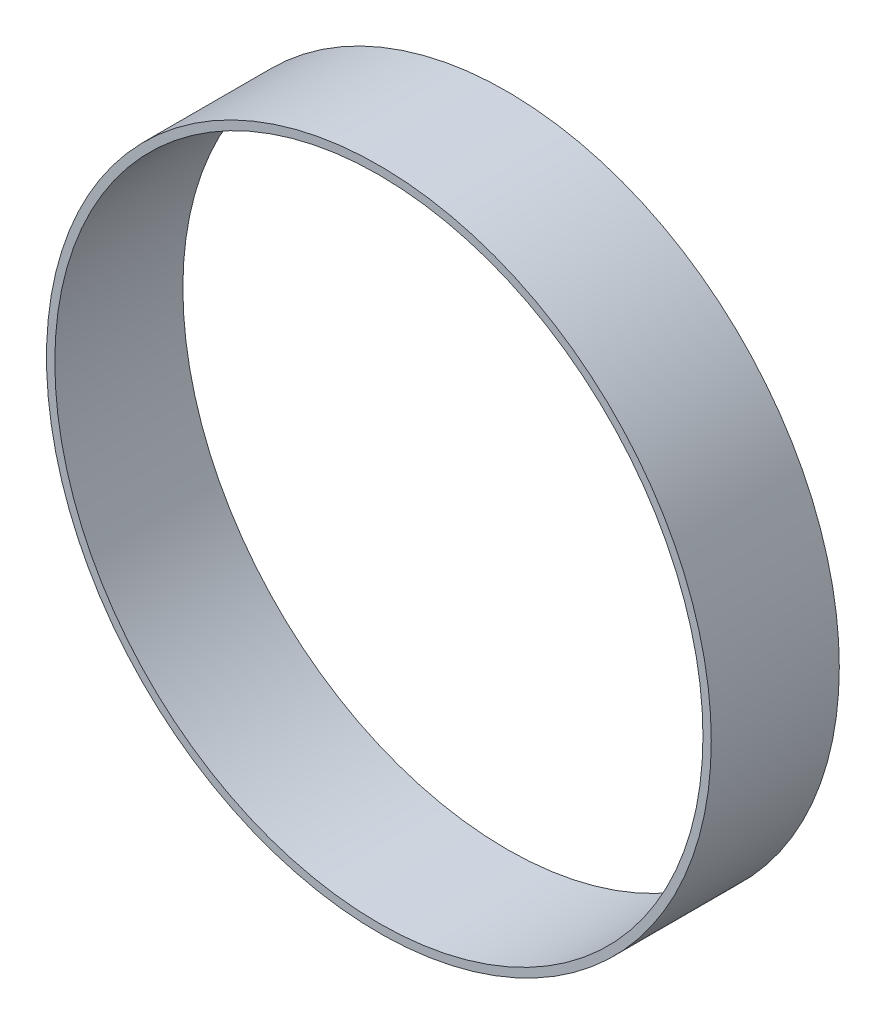
ISO-10303-21;
HEADER;
FILE_DESCRIPTION(('STEP AP214'),'2;1');
FILE_NAME('part.step','',(''),(''),'','','');
FILE_SCHEMA(('AUTOMOTIVE_DESIGN { 1 0 10303 214 1 1 1 1 }'));
ENDSEC;
DATA;
#1=APPLICATION_CONTEXT('core data for automotive mechanical design processes');
#2=APPLICATION_PROTOCOL_DEFINITION('international standard','automotive_design',2000,#1);
#3=PRODUCT_CONTEXT('',#1,'mechanical');
#4=PRODUCT('Part','Part','',(#3));
#5=PRODUCT_RELATED_PRODUCT_CATEGORY('part','',(#4));
#6=PRODUCT_DEFINITION_FORMATION('','',#4);
#7=PRODUCT_DEFINITION_CONTEXT('part definition',#1,'design');
#8=PRODUCT_DEFINITION('design','',#6,#7);
#9=PRODUCT_DEFINITION_SHAPE('','',#8);
#10=(LENGTH_UNIT() NAMED_UNIT(*) SI_UNIT(.MILLI.,.METRE.));
#11=(NAMED_UNIT(*) PLANE_ANGLE_UNIT() SI_UNIT($,.RADIAN.));
#12=(NAMED_UNIT(*) SI_UNIT($,.STERADIAN.) SOLID_ANGLE_UNIT());
#13=UNCERTAINTY_MEASURE_WITH_UNIT(LENGTH_MEASURE(1.E-05),#10,'distance_accuracy_value','');
#14=(GEOMETRIC_REPRESENTATION_CONTEXT(3) GLOBAL_UNCERTAINTY_ASSIGNED_CONTEXT((#13)) GLOBAL_UNIT_ASSIGNED_CONTEXT((#10,
#11,#12)) REPRESENTATION_CONTEXT('',''));
#15=CARTESIAN_POINT('',(0.,0.,0.));
#16=DIRECTION('',(0.,0.,1.));
#17=DIRECTION('',(1.,0.,0.));
#18=AXIS2_PLACEMENT_3D('',#15,#16,#17);
#19=CARTESIAN_POINT('',(0.,0.,0.));
#20=DIRECTION('',(0.,0.,-1.));
#21=DIRECTION('',(1.,0.,0.));
#22=AXIS2_PLACEMENT_3D('',#19,#20,#21);
#23=CYLINDRICAL_SURFACE('',#22,1.01540056);
#24=CARTESIAN_POINT('',(0.,0.,0.39116));
#25=DIRECTION('',(0.,0.,1.));
#26=DIRECTION('',(1.,0.,0.));
#27=AXIS2_PLACEMENT_3D('',#24,#25,#26);
#28=CIRCLE('',#27,1.01540056);
#29=CARTESIAN_POINT('',(1.01540056,0.,0.39116));
#30=VERTEX_POINT('',#29);
#31=EDGE_CURVE('E11',#30,#30,#28,.T.);
#32=ORIENTED_EDGE('',*,*,#31,.F.);
#33=DIRECTION('',(0.,0.,1.));
#34=VECTOR('',#33,1.);
#35=CARTESIAN_POINT('',(1.01540056,0.,0.));
#36=LINE('',#35,#34);
#37=CARTESIAN_POINT('',(1.01540056,0.,0.));
#38=VERTEX_POINT('',#37);
#39=EDGE_CURVE('E24',#38,#30,#36,.T.);
#40=ORIENTED_EDGE('',*,*,#39,.F.);
#41=CARTESIAN_POINT('',(0.,0.,0.));
#42=DIRECTION('',(0.,0.,1.));
#43=DIRECTION('',(1.,0.,0.));
#44=AXIS2_PLACEMENT_3D('',#41,#42,#43);
#45=CIRCLE('',#44,1.01540056);
#46=EDGE_CURVE('E46',#38,#38,#45,.T.);
#47=ORIENTED_EDGE('',*,*,#46,.T.);
#48=ORIENTED_EDGE('',*,*,#39,.T.);
#49=EDGE_LOOP('',(#32,#40,#47,#48));
#50=FACE_BOUND('',#49,.T.);
#51=ADVANCED_FACE('F17',(#50),#23,.T.);
#52=CARTESIAN_POINT('',(0.,0.,0.));
#53=DIRECTION('',(0.,0.,-1.));
#54=DIRECTION('',(1.,0.,0.));
#55=AXIS2_PLACEMENT_3D('',#52,#53,#54);
#56=CYLINDRICAL_SURFACE('',#55,0.99000056);
#57=DIRECTION('',(0.,0.,1.));
#58=VECTOR('',#57,1.);
#59=CARTESIAN_POINT('',(0.99000056,0.,0.));
#60=LINE('',#59,#58);
#61=CARTESIAN_POINT('',(0.99000056,0.,0.));
#62=VERTEX_POINT('',#61);
#63=CARTESIAN_POINT('',(0.99000056,0.,0.39116));
#64=VERTEX_POINT('',#63);
#65=EDGE_CURVE('E40',#62,#64,#60,.T.);
#66=ORIENTED_EDGE('',*,*,#65,.T.);
#67=CARTESIAN_POINT('',(0.,0.,0.39116));
#68=DIRECTION('',(0.,0.,1.));
#69=DIRECTION('',(1.,0.,0.));
#70=AXIS2_PLACEMENT_3D('',#67,#68,#69);
#71=CIRCLE('',#70,0.99000056);
#72=EDGE_CURVE('E45',#64,#64,#71,.T.);
#73=ORIENTED_EDGE('',*,*,#72,.T.);
#74=ORIENTED_EDGE('',*,*,#65,.F.);
#75=CARTESIAN_POINT('',(0.,0.,0.));
#76=DIRECTION('',(0.,0.,1.));
#77=DIRECTION('',(1.,0.,0.));
#78=AXIS2_PLACEMENT_3D('',#75,#76,#77);
#79=CIRCLE('',#78,0.99000056);
#80=EDGE_CURVE('E43',#62,#62,#79,.T.);
#81=ORIENTED_EDGE('',*,*,#80,.F.);
#82=EDGE_LOOP('',(#66,#73,#74,#81));
#83=FACE_BOUND('',#82,.T.);
#84=ADVANCED_FACE('F42',(#83),#56,.F.);
#85=CARTESIAN_POINT('',(1.01540056,0.,0.));
#86=DIRECTION('',(0.,0.,-1.));
#87=DIRECTION('',(-1.,0.,0.));
#88=AXIS2_PLACEMENT_3D('',#85,#86,#87);
#89=PLANE('',#88);
#90=ORIENTED_EDGE('',*,*,#46,.F.);
#91=EDGE_LOOP('',(#90));
#92=FACE_BOUND('',#91,.T.);
#93=ORIENTED_EDGE('',*,*,#80,.T.);
#94=EDGE_LOOP('',(#93));
#95=FACE_BOUND('',#94,.T.);
#96=ADVANCED_FACE('F49',(#92,#95),#89,.T.);
#97=CARTESIAN_POINT('',(1.01540056,0.,0.39116));
#98=DIRECTION('',(0.,0.,-1.));
#99=DIRECTION('',(-1.,0.,0.));
#100=AXIS2_PLACEMENT_3D('',#97,#98,#99);
#101=PLANE('',#100);
#102=ORIENTED_EDGE('',*,*,#31,.T.);
#103=EDGE_LOOP('',(#102));
#104=FACE_BOUND('',#103,.T.);
#105=ORIENTED_EDGE('',*,*,#72,.F.);
#106=EDGE_LOOP('',(#105));
#107=FACE_BOUND('',#106,.T.);
#108=ADVANCED_FACE('F56',(#104,#107),#101,.F.);
#109=CLOSED_SHELL('',(#51,#84,#96,#108));
#110=MANIFOLD_SOLID_BREP('B1',#109);
#111=ADVANCED_BREP_SHAPE_REPRESENTATION('',(#18,#110),#14);
#112=SHAPE_DEFINITION_REPRESENTATION(#9,#111);
ENDSEC;
END-ISO-10303-21;
